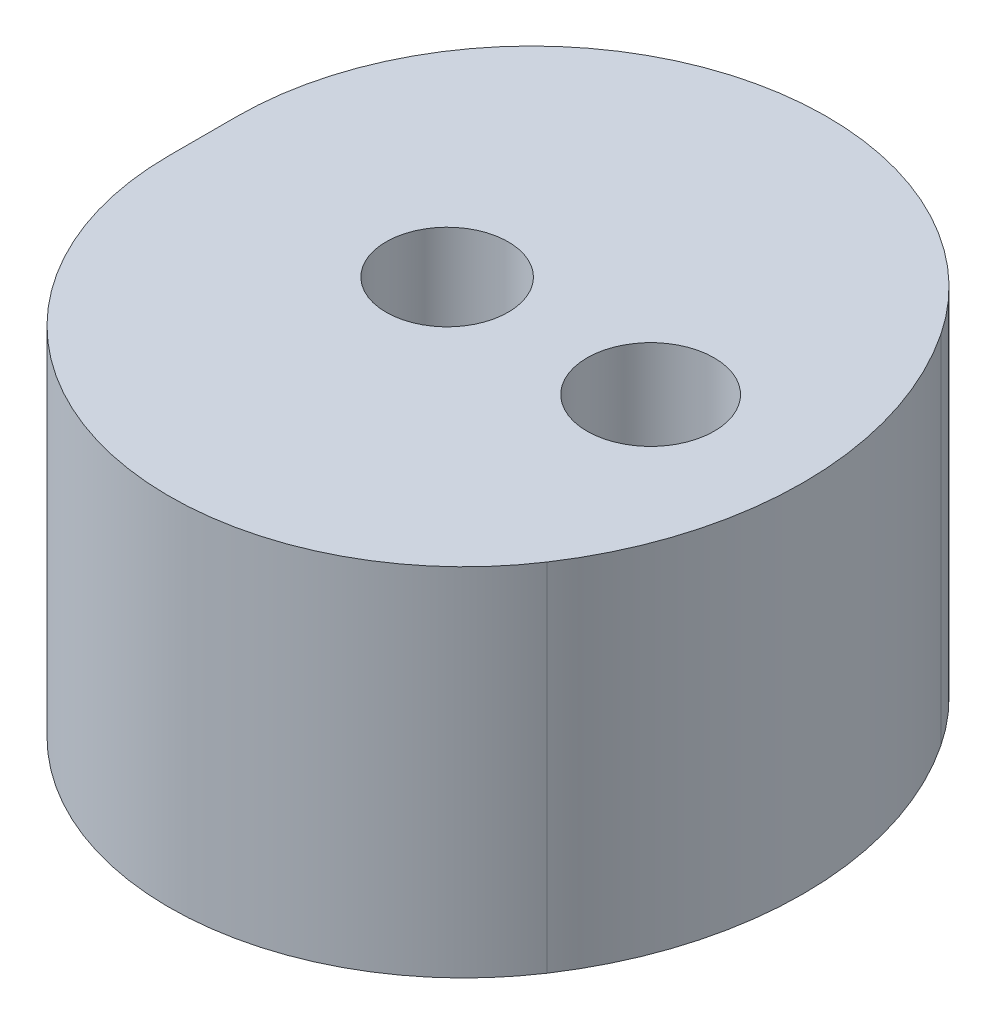
ISO-10303-21;
HEADER;
FILE_DESCRIPTION(('STEP AP214'),'2;1');
FILE_NAME('part.step','',(''),(''),'','','');
FILE_SCHEMA(('AUTOMOTIVE_DESIGN { 1 0 10303 214 1 1 1 1 }'));
ENDSEC;
DATA;
#1=APPLICATION_CONTEXT('core data for automotive mechanical design processes');
#2=APPLICATION_PROTOCOL_DEFINITION('international standard','automotive_design',2000,#1);
#3=PRODUCT_CONTEXT('',#1,'mechanical');
#4=PRODUCT('Part','Part','',(#3));
#5=PRODUCT_RELATED_PRODUCT_CATEGORY('part','',(#4));
#6=PRODUCT_DEFINITION_FORMATION('','',#4);
#7=PRODUCT_DEFINITION_CONTEXT('part definition',#1,'design');
#8=PRODUCT_DEFINITION('design','',#6,#7);
#9=PRODUCT_DEFINITION_SHAPE('','',#8);
#10=(LENGTH_UNIT() NAMED_UNIT(*) SI_UNIT(.MILLI.,.METRE.));
#11=(NAMED_UNIT(*) PLANE_ANGLE_UNIT() SI_UNIT($,.RADIAN.));
#12=(NAMED_UNIT(*) SI_UNIT($,.STERADIAN.) SOLID_ANGLE_UNIT());
#13=UNCERTAINTY_MEASURE_WITH_UNIT(LENGTH_MEASURE(1.E-05),#10,'distance_accuracy_value','');
#14=(GEOMETRIC_REPRESENTATION_CONTEXT(3) GLOBAL_UNCERTAINTY_ASSIGNED_CONTEXT((#13)) GLOBAL_UNIT_ASSIGNED_CONTEXT((#10,
#11,#12)) REPRESENTATION_CONTEXT('',''));
#15=CARTESIAN_POINT('',(0.,0.,0.));
#16=DIRECTION('',(0.,0.,1.));
#17=DIRECTION('',(1.,0.,0.));
#18=AXIS2_PLACEMENT_3D('',#15,#16,#17);
#19=CARTESIAN_POINT('',(18.25,7.,-14.1233333333333));
#20=DIRECTION('',(0.,-1.,0.));
#21=DIRECTION('',(0.,0.,-1.));
#22=AXIS2_PLACEMENT_3D('',#19,#20,#21);
#23=CYLINDRICAL_SURFACE('',#22,1.25);
#24=CARTESIAN_POINT('',(18.25,7.,-14.1233333333333));
#25=DIRECTION('',(0.,1.,0.));
#26=DIRECTION('',(0.,0.,1.));
#27=AXIS2_PLACEMENT_3D('',#24,#25,#26);
#28=CIRCLE('',#27,1.25);
#29=CARTESIAN_POINT('',(18.25,7.,-12.8733333333333));
#30=VERTEX_POINT('',#29);
#31=EDGE_CURVE('E133',#30,#30,#28,.T.);
#32=ORIENTED_EDGE('',*,*,#31,.T.);
#33=EDGE_LOOP('',(#32));
#34=FACE_BOUND('',#33,.T.);
#35=CARTESIAN_POINT('',(18.25,3.5,-14.1233333333333));
#36=DIRECTION('',(0.,-1.,0.));
#37=DIRECTION('',(0.,0.,-1.));
#38=AXIS2_PLACEMENT_3D('',#35,#36,#37);
#39=CIRCLE('',#38,1.25);
#40=CARTESIAN_POINT('',(18.25,3.5,-15.3733333333333));
#41=VERTEX_POINT('',#40);
#42=EDGE_CURVE('E143',#41,#41,#39,.F.);
#43=ORIENTED_EDGE('',*,*,#42,.F.);
#44=EDGE_LOOP('',(#43));
#45=FACE_BOUND('',#44,.T.);
#46=ADVANCED_FACE('F41',(#34,#45),#23,.F.);
#47=CARTESIAN_POINT('',(14.25,7.,-14.1233333333333));
#48=DIRECTION('',(0.,-1.,0.));
#49=DIRECTION('',(0.,0.,-1.));
#50=AXIS2_PLACEMENT_3D('',#47,#48,#49);
#51=PLANE('',#50);
#52=DIRECTION('',(0.,0.,1.));
#53=VECTOR('',#52,1.);
#54=CARTESIAN_POINT('',(9.45,7.,-19.2184290144761));
#55=LINE('',#54,#53);
#56=CARTESIAN_POINT('',(9.45,7.,-14.7866582914044));
#57=VERTEX_POINT('',#56);
#58=CARTESIAN_POINT('',(9.45,7.,-13.4600083752623));
#59=VERTEX_POINT('',#58);
#60=EDGE_CURVE('E116',#57,#59,#55,.T.);
#61=ORIENTED_EDGE('',*,*,#60,.T.);
#62=CARTESIAN_POINT('',(15.25,7.,-13.4600083752623));
#63=DIRECTION('',(0.,-1.,0.));
#64=DIRECTION('',(0.,0.,-1.));
#65=AXIS2_PLACEMENT_3D('',#62,#63,#64);
#66=CIRCLE('',#65,5.8);
#67=CARTESIAN_POINT('',(20.0833333333333,7.,-10.2539377445854));
#68=VERTEX_POINT('',#67);
#69=EDGE_CURVE('E11',#59,#68,#66,.F.);
#70=ORIENTED_EDGE('',*,*,#69,.T.);
#71=CARTESIAN_POINT('',(14.25,7.,-14.1233333333333));
#72=DIRECTION('',(0.,1.,0.));
#73=DIRECTION('',(0.,0.,-1.));
#74=AXIS2_PLACEMENT_3D('',#71,#72,#73);
#75=CIRCLE('',#74,7.);
#76=CARTESIAN_POINT('',(20.0833333333333,7.,-17.9927289220813));
#77=VERTEX_POINT('',#76);
#78=EDGE_CURVE('E100',#68,#77,#75,.T.);
#79=ORIENTED_EDGE('',*,*,#78,.T.);
#80=CARTESIAN_POINT('',(15.25,7.,-14.7866582914044));
#81=DIRECTION('',(0.,-1.,0.));
#82=DIRECTION('',(0.,0.,-1.));
#83=AXIS2_PLACEMENT_3D('',#80,#81,#82);
#84=CIRCLE('',#83,5.8);
#85=EDGE_CURVE('E50',#77,#57,#84,.F.);
#86=ORIENTED_EDGE('',*,*,#85,.T.);
#87=EDGE_LOOP('',(#61,#70,#79,#86));
#88=FACE_BOUND('',#87,.T.);
#89=CARTESIAN_POINT('',(14.25,7.,-14.1233333333333));
#90=DIRECTION('',(0.,1.,0.));
#91=DIRECTION('',(0.,0.,1.));
#92=AXIS2_PLACEMENT_3D('',#89,#90,#91);
#93=CIRCLE('',#92,1.2);
#94=CARTESIAN_POINT('',(14.25,7.,-12.9233333333333));
#95=VERTEX_POINT('',#94);
#96=EDGE_CURVE('E107',#95,#95,#93,.T.);
#97=ORIENTED_EDGE('',*,*,#96,.F.);
#98=EDGE_LOOP('',(#97));
#99=FACE_BOUND('',#98,.T.);
#100=ORIENTED_EDGE('',*,*,#31,.F.);
#101=EDGE_LOOP('',(#100));
#102=FACE_BOUND('',#101,.T.);
#103=ADVANCED_FACE('F155',(#88,#99,#102),#51,.F.);
#104=CARTESIAN_POINT('',(14.25,0.,-14.1233333333333));
#105=DIRECTION('',(0.,-1.,0.));
#106=DIRECTION('',(0.,0.,-1.));
#107=AXIS2_PLACEMENT_3D('',#104,#105,#106);
#108=PLANE('',#107);
#109=CARTESIAN_POINT('',(18.25,0.,-14.1233333333333));
#110=DIRECTION('',(0.,-1.,0.));
#111=DIRECTION('',(0.,0.,-1.));
#112=AXIS2_PLACEMENT_3D('',#109,#110,#111);
#113=CIRCLE('',#112,2.15);
#114=CARTESIAN_POINT('',(18.25,0.,-16.2733333333333));
#115=VERTEX_POINT('',#114);
#116=EDGE_CURVE('E139',#115,#115,#113,.T.);
#117=ORIENTED_EDGE('',*,*,#116,.F.);
#118=EDGE_LOOP('',(#117));
#119=FACE_BOUND('',#118,.T.);
#120=CARTESIAN_POINT('',(14.25,0.,-14.1233333333333));
#121=DIRECTION('',(0.,1.,0.));
#122=DIRECTION('',(0.,0.,1.));
#123=AXIS2_PLACEMENT_3D('',#120,#121,#122);
#124=CIRCLE('',#123,1.2);
#125=CARTESIAN_POINT('',(14.25,0.,-12.9233333333333));
#126=VERTEX_POINT('',#125);
#127=EDGE_CURVE('E113',#126,#126,#124,.T.);
#128=ORIENTED_EDGE('',*,*,#127,.T.);
#129=EDGE_LOOP('',(#128));
#130=FACE_BOUND('',#129,.T.);
#131=CARTESIAN_POINT('',(14.25,0.,-14.1233333333333));
#132=DIRECTION('',(0.,1.,0.));
#133=DIRECTION('',(0.,0.,-1.));
#134=AXIS2_PLACEMENT_3D('',#131,#132,#133);
#135=CIRCLE('',#134,7.);
#136=CARTESIAN_POINT('',(20.0833333333333,0.,-10.2539377445854));
#137=VERTEX_POINT('',#136);
#138=CARTESIAN_POINT('',(20.0833333333333,0.,-17.9927289220813));
#139=VERTEX_POINT('',#138);
#140=EDGE_CURVE('E98',#137,#139,#135,.T.);
#141=ORIENTED_EDGE('',*,*,#140,.F.);
#142=CARTESIAN_POINT('',(15.25,0.,-13.4600083752623));
#143=DIRECTION('',(0.,-1.,0.));
#144=DIRECTION('',(0.,0.,-1.));
#145=AXIS2_PLACEMENT_3D('',#142,#143,#144);
#146=CIRCLE('',#145,5.8);
#147=CARTESIAN_POINT('',(9.45,0.,-13.4600083752623));
#148=VERTEX_POINT('',#147);
#149=EDGE_CURVE('E82',#137,#148,#146,.T.);
#150=ORIENTED_EDGE('',*,*,#149,.T.);
#151=DIRECTION('',(0.,0.,1.));
#152=VECTOR('',#151,1.);
#153=CARTESIAN_POINT('',(9.45,0.,-19.2184290144761));
#154=LINE('',#153,#152);
#155=CARTESIAN_POINT('',(9.45,0.,-14.7866582914044));
#156=VERTEX_POINT('',#155);
#157=EDGE_CURVE('E106',#156,#148,#154,.T.);
#158=ORIENTED_EDGE('',*,*,#157,.F.);
#159=CARTESIAN_POINT('',(15.25,0.,-14.7866582914044));
#160=DIRECTION('',(0.,-1.,0.));
#161=DIRECTION('',(0.,0.,-1.));
#162=AXIS2_PLACEMENT_3D('',#159,#160,#161);
#163=CIRCLE('',#162,5.8);
#164=EDGE_CURVE('E92',#156,#139,#163,.T.);
#165=ORIENTED_EDGE('',*,*,#164,.T.);
#166=EDGE_LOOP('',(#141,#150,#158,#165));
#167=FACE_BOUND('',#166,.T.);
#168=ADVANCED_FACE('F104',(#119,#130,#167),#108,.T.);
#169=CARTESIAN_POINT('',(14.25,7.,-14.1233333333333));
#170=DIRECTION('',(0.,-1.,0.));
#171=DIRECTION('',(0.,0.,-1.));
#172=AXIS2_PLACEMENT_3D('',#169,#170,#171);
#173=CYLINDRICAL_SURFACE('',#172,7.);
#174=ORIENTED_EDGE('',*,*,#78,.F.);
#175=DIRECTION('',(0.,-1.,0.));
#176=VECTOR('',#175,1.);
#177=CARTESIAN_POINT('',(20.0833333333333,7.,-10.2539377445854));
#178=LINE('',#177,#176);
#179=EDGE_CURVE('E86',#68,#137,#178,.T.);
#180=ORIENTED_EDGE('',*,*,#179,.T.);
#181=ORIENTED_EDGE('',*,*,#140,.T.);
#182=DIRECTION('',(0.,-1.,0.));
#183=VECTOR('',#182,1.);
#184=CARTESIAN_POINT('',(20.0833333333333,7.,-17.9927289220813));
#185=LINE('',#184,#183);
#186=EDGE_CURVE('E102',#139,#77,#185,.F.);
#187=ORIENTED_EDGE('',*,*,#186,.T.);
#188=EDGE_LOOP('',(#174,#180,#181,#187));
#189=FACE_BOUND('',#188,.T.);
#190=ADVANCED_FACE('F97',(#189),#173,.T.);
#191=CARTESIAN_POINT('',(9.45,7.,-19.2184290144761));
#192=DIRECTION('',(1.,0.,0.));
#193=DIRECTION('',(0.,0.,-1.));
#194=AXIS2_PLACEMENT_3D('',#191,#192,#193);
#195=PLANE('',#194);
#196=ORIENTED_EDGE('',*,*,#157,.T.);
#197=DIRECTION('',(0.,-1.,0.));
#198=VECTOR('',#197,1.);
#199=CARTESIAN_POINT('',(9.45,7.,-13.4600083752622));
#200=LINE('',#199,#198);
#201=EDGE_CURVE('E57',#148,#59,#200,.F.);
#202=ORIENTED_EDGE('',*,*,#201,.T.);
#203=ORIENTED_EDGE('',*,*,#60,.F.);
#204=DIRECTION('',(0.,-1.,0.));
#205=VECTOR('',#204,1.);
#206=CARTESIAN_POINT('',(9.45,7.,-14.7866582914044));
#207=LINE('',#206,#205);
#208=EDGE_CURVE('E91',#57,#156,#207,.T.);
#209=ORIENTED_EDGE('',*,*,#208,.T.);
#210=EDGE_LOOP('',(#196,#202,#203,#209));
#211=FACE_BOUND('',#210,.T.);
#212=ADVANCED_FACE('F168',(#211),#195,.F.);
#213=CARTESIAN_POINT('',(14.25,7.,-14.1233333333333));
#214=DIRECTION('',(0.,-1.,0.));
#215=DIRECTION('',(0.,0.,-1.));
#216=AXIS2_PLACEMENT_3D('',#213,#214,#215);
#217=CYLINDRICAL_SURFACE('',#216,1.2);
#218=ORIENTED_EDGE('',*,*,#96,.T.);
#219=EDGE_LOOP('',(#218));
#220=FACE_BOUND('',#219,.T.);
#221=ORIENTED_EDGE('',*,*,#127,.F.);
#222=EDGE_LOOP('',(#221));
#223=FACE_BOUND('',#222,.T.);
#224=ADVANCED_FACE('F166',(#220,#223),#217,.F.);
#225=CARTESIAN_POINT('',(18.25,3.5,-14.1233333333333));
#226=DIRECTION('',(0.,-1.,0.));
#227=DIRECTION('',(0.,0.,-1.));
#228=AXIS2_PLACEMENT_3D('',#225,#226,#227);
#229=CYLINDRICAL_SURFACE('',#228,2.15);
#230=CARTESIAN_POINT('',(18.25,3.5,-14.1233333333333));
#231=DIRECTION('',(0.,-1.,0.));
#232=DIRECTION('',(0.,0.,-1.));
#233=AXIS2_PLACEMENT_3D('',#230,#231,#232);
#234=CIRCLE('',#233,2.15);
#235=CARTESIAN_POINT('',(18.25,3.5,-16.2733333333333));
#236=VERTEX_POINT('',#235);
#237=EDGE_CURVE('E138',#236,#236,#234,.T.);
#238=ORIENTED_EDGE('',*,*,#237,.F.);
#239=EDGE_LOOP('',(#238));
#240=FACE_BOUND('',#239,.T.);
#241=ORIENTED_EDGE('',*,*,#116,.T.);
#242=EDGE_LOOP('',(#241));
#243=FACE_BOUND('',#242,.T.);
#244=ADVANCED_FACE('F164',(#240,#243),#229,.F.);
#245=CARTESIAN_POINT('',(0.,3.5,0.));
#246=DIRECTION('',(0.,-1.,0.));
#247=DIRECTION('',(0.,0.,-1.));
#248=AXIS2_PLACEMENT_3D('',#245,#246,#247);
#249=PLANE('',#248);
#250=ORIENTED_EDGE('',*,*,#42,.T.);
#251=EDGE_LOOP('',(#250));
#252=FACE_BOUND('',#251,.T.);
#253=ORIENTED_EDGE('',*,*,#237,.T.);
#254=EDGE_LOOP('',(#253));
#255=FACE_BOUND('',#254,.T.);
#256=ADVANCED_FACE('F151',(#252,#255),#249,.T.);
#257=CARTESIAN_POINT('',(15.25,7.,-13.4600083752623));
#258=DIRECTION('',(0.,-1.,0.));
#259=DIRECTION('',(0.,0.,-1.));
#260=AXIS2_PLACEMENT_3D('',#257,#258,#259);
#261=CYLINDRICAL_SURFACE('',#260,5.8);
#262=ORIENTED_EDGE('',*,*,#69,.F.);
#263=ORIENTED_EDGE('',*,*,#201,.F.);
#264=ORIENTED_EDGE('',*,*,#149,.F.);
#265=ORIENTED_EDGE('',*,*,#179,.F.);
#266=EDGE_LOOP('',(#262,#263,#264,#265));
#267=FACE_BOUND('',#266,.T.);
#268=ADVANCED_FACE('F85',(#267),#261,.T.);
#269=CARTESIAN_POINT('',(15.25,7.,-14.7866582914044));
#270=DIRECTION('',(0.,-1.,0.));
#271=DIRECTION('',(0.,0.,-1.));
#272=AXIS2_PLACEMENT_3D('',#269,#270,#271);
#273=CYLINDRICAL_SURFACE('',#272,5.8);
#274=ORIENTED_EDGE('',*,*,#85,.F.);
#275=ORIENTED_EDGE('',*,*,#186,.F.);
#276=ORIENTED_EDGE('',*,*,#164,.F.);
#277=ORIENTED_EDGE('',*,*,#208,.F.);
#278=EDGE_LOOP('',(#274,#275,#276,#277));
#279=FACE_BOUND('',#278,.T.);
#280=ADVANCED_FACE('F43',(#279),#273,.T.);
#281=CLOSED_SHELL('',(#46,#103,#168,#190,#212,#224,#244,#256,#268,#280));
#282=MANIFOLD_SOLID_BREP('B2',#281);
#283=ADVANCED_BREP_SHAPE_REPRESENTATION('',(#18,#282),#14);
#284=SHAPE_DEFINITION_REPRESENTATION(#9,#283);
ENDSEC;
END-ISO-10303-21;
